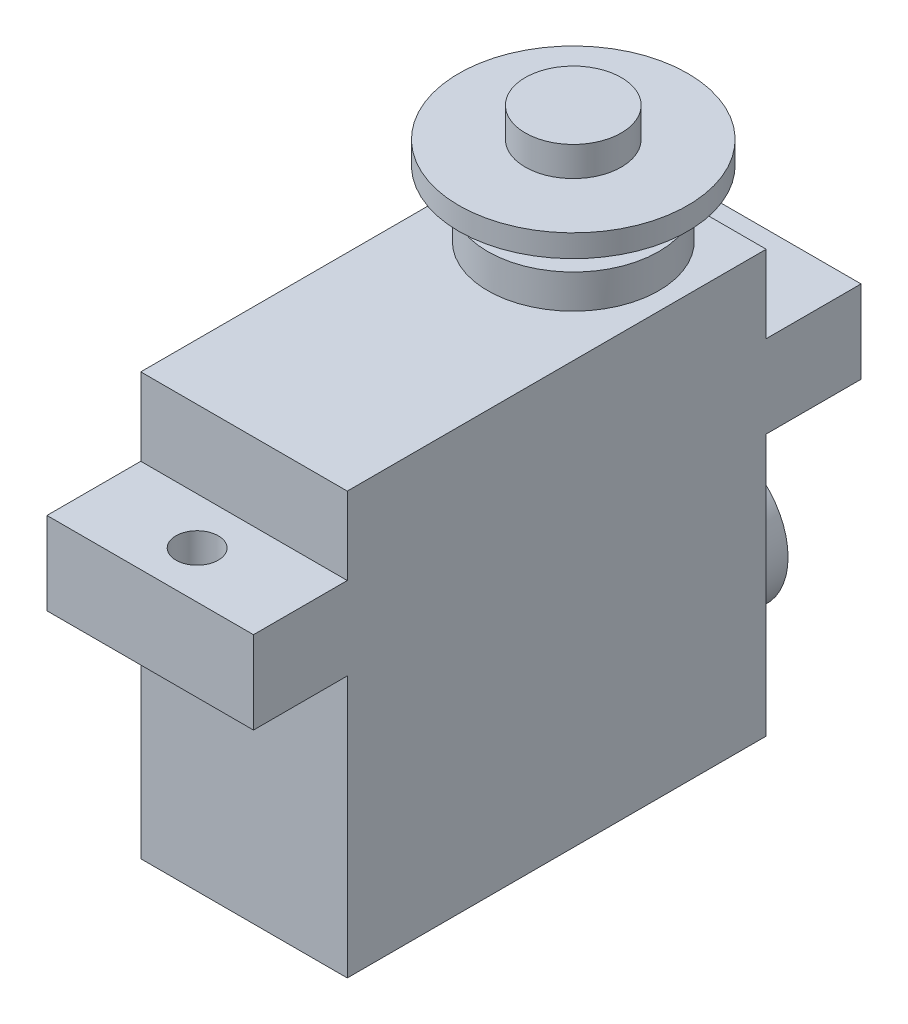
ISO-10303-21;
HEADER;
FILE_DESCRIPTION(('STEP AP214'),'2;1');
FILE_NAME('part.step','',(''),(''),'','','');
FILE_SCHEMA(('AUTOMOTIVE_DESIGN { 1 0 10303 214 1 1 1 1 }'));
ENDSEC;
DATA;
#1=APPLICATION_CONTEXT('core data for automotive mechanical design processes');
#2=APPLICATION_PROTOCOL_DEFINITION('international standard','automotive_design',2000,#1);
#3=PRODUCT_CONTEXT('',#1,'mechanical');
#4=PRODUCT('Part','Part','',(#3));
#5=PRODUCT_RELATED_PRODUCT_CATEGORY('part','',(#4));
#6=PRODUCT_DEFINITION_FORMATION('','',#4);
#7=PRODUCT_DEFINITION_CONTEXT('part definition',#1,'design');
#8=PRODUCT_DEFINITION('design','',#6,#7);
#9=PRODUCT_DEFINITION_SHAPE('','',#8);
#10=(LENGTH_UNIT() NAMED_UNIT(*) SI_UNIT(.MILLI.,.METRE.));
#11=(NAMED_UNIT(*) PLANE_ANGLE_UNIT() SI_UNIT($,.RADIAN.));
#12=(NAMED_UNIT(*) SI_UNIT($,.STERADIAN.) SOLID_ANGLE_UNIT());
#13=UNCERTAINTY_MEASURE_WITH_UNIT(LENGTH_MEASURE(1.E-05),#10,'distance_accuracy_value','');
#14=(GEOMETRIC_REPRESENTATION_CONTEXT(3) GLOBAL_UNCERTAINTY_ASSIGNED_CONTEXT((#13)) GLOBAL_UNIT_ASSIGNED_CONTEXT((#10,
#11,#12)) REPRESENTATION_CONTEXT('',''));
#15=CARTESIAN_POINT('',(0.,0.,0.));
#16=DIRECTION('',(0.,0.,1.));
#17=DIRECTION('',(1.,0.,0.));
#18=AXIS2_PLACEMENT_3D('',#15,#16,#17);
#19=CARTESIAN_POINT('',(0.,31.115,0.));
#20=DIRECTION('',(0.,0.,-1.));
#21=DIRECTION('',(-1.,0.,0.));
#22=AXIS2_PLACEMENT_3D('',#19,#20,#21);
#23=PLANE('',#22);
#24=DIRECTION('',(0.,-1.,0.));
#25=VECTOR('',#24,1.);
#26=CARTESIAN_POINT('',(0.,31.115,0.));
#27=LINE('',#26,#25);
#28=CARTESIAN_POINT('',(0.,31.115,0.));
#29=VERTEX_POINT('',#28);
#30=CARTESIAN_POINT('',(0.,25.4,0.));
#31=VERTEX_POINT('',#30);
#32=EDGE_CURVE('E220',#29,#31,#27,.T.);
#33=ORIENTED_EDGE('',*,*,#32,.T.);
#34=DIRECTION('',(1.,0.,0.));
#35=VECTOR('',#34,1.);
#36=CARTESIAN_POINT('',(0.,25.4,0.));
#37=LINE('',#36,#35);
#38=CARTESIAN_POINT('',(15.2399999999999,25.4,0.));
#39=VERTEX_POINT('',#38);
#40=EDGE_CURVE('E185',#31,#39,#37,.T.);
#41=ORIENTED_EDGE('',*,*,#40,.T.);
#42=DIRECTION('',(0.,-1.,0.));
#43=VECTOR('',#42,1.);
#44=CARTESIAN_POINT('',(15.2399999999999,31.115,0.));
#45=LINE('',#44,#43);
#46=CARTESIAN_POINT('',(15.2399999999999,31.115,0.));
#47=VERTEX_POINT('',#46);
#48=EDGE_CURVE('E217',#47,#39,#45,.T.);
#49=ORIENTED_EDGE('',*,*,#48,.F.);
#50=DIRECTION('',(1.,0.,0.));
#51=VECTOR('',#50,1.);
#52=CARTESIAN_POINT('',(0.,31.115,0.));
#53=LINE('',#52,#51);
#54=EDGE_CURVE('E192',#29,#47,#53,.T.);
#55=ORIENTED_EDGE('',*,*,#54,.F.);
#56=EDGE_LOOP('',(#33,#41,#49,#55));
#57=FACE_BOUND('',#56,.T.);
#58=ADVANCED_FACE('F42',(#57),#23,.F.);
#59=CARTESIAN_POINT('',(0.,31.115,-30.9117999999999));
#60=DIRECTION('',(0.,0.,1.));
#61=DIRECTION('',(1.,0.,0.));
#62=AXIS2_PLACEMENT_3D('',#59,#60,#61);
#63=PLANE('',#62);
#64=DIRECTION('',(0.,-1.,0.));
#65=VECTOR('',#64,1.);
#66=CARTESIAN_POINT('',(15.2399999999999,31.115,-30.9118));
#67=LINE('',#66,#65);
#68=CARTESIAN_POINT('',(15.2399999999999,31.115,-30.9118));
#69=VERTEX_POINT('',#68);
#70=CARTESIAN_POINT('',(15.2399999999999,25.4,-30.9118));
#71=VERTEX_POINT('',#70);
#72=EDGE_CURVE('E213',#69,#71,#67,.T.);
#73=ORIENTED_EDGE('',*,*,#72,.T.);
#74=DIRECTION('',(-1.,0.,0.));
#75=VECTOR('',#74,1.);
#76=CARTESIAN_POINT('',(0.,25.4,-30.9117999999999));
#77=LINE('',#76,#75);
#78=CARTESIAN_POINT('',(0.,25.4,-30.9118));
#79=VERTEX_POINT('',#78);
#80=EDGE_CURVE('E225',#71,#79,#77,.T.);
#81=ORIENTED_EDGE('',*,*,#80,.T.);
#82=DIRECTION('',(0.,-1.,0.));
#83=VECTOR('',#82,1.);
#84=CARTESIAN_POINT('',(0.,31.115,-30.9117999999999));
#85=LINE('',#84,#83);
#86=CARTESIAN_POINT('',(0.,31.115,-30.9117999999999));
#87=VERTEX_POINT('',#86);
#88=EDGE_CURVE('E209',#87,#79,#85,.T.);
#89=ORIENTED_EDGE('',*,*,#88,.F.);
#90=DIRECTION('',(-1.,0.,0.));
#91=VECTOR('',#90,1.);
#92=CARTESIAN_POINT('',(0.,31.115,-30.9117999999999));
#93=LINE('',#92,#91);
#94=EDGE_CURVE('E197',#69,#87,#93,.T.);
#95=ORIENTED_EDGE('',*,*,#94,.F.);
#96=EDGE_LOOP('',(#73,#81,#89,#95));
#97=FACE_BOUND('',#96,.T.);
#98=ADVANCED_FACE('F295',(#97),#63,.F.);
#99=CARTESIAN_POINT('',(0.,31.115,0.));
#100=DIRECTION('',(1.,0.,0.));
#101=DIRECTION('',(0.,0.,-1.));
#102=AXIS2_PLACEMENT_3D('',#99,#100,#101);
#103=PLANE('',#102);
#104=CARTESIAN_POINT('',(0.,19.304,0.));
#105=VERTEX_POINT('',#104);
#106=CARTESIAN_POINT('',(0.,0.,0.));
#107=VERTEX_POINT('',#106);
#108=EDGE_CURVE('E137',#105,#107,#27,.T.);
#109=ORIENTED_EDGE('',*,*,#108,.F.);
#110=DIRECTION('',(0.,0.,1.));
#111=VECTOR('',#110,1.);
#112=CARTESIAN_POINT('',(0.,19.304,-37.9095));
#113=LINE('',#112,#111);
#114=CARTESIAN_POINT('',(0.,19.304,6.9215));
#115=VERTEX_POINT('',#114);
#116=EDGE_CURVE('E59',#105,#115,#113,.T.);
#117=ORIENTED_EDGE('',*,*,#116,.T.);
#118=DIRECTION('',(0.,-1.,0.));
#119=VECTOR('',#118,1.);
#120=CARTESIAN_POINT('',(0.,25.4,6.9215));
#121=LINE('',#120,#119);
#122=CARTESIAN_POINT('',(0.,25.4,6.9215));
#123=VERTEX_POINT('',#122);
#124=EDGE_CURVE('E135',#123,#115,#121,.T.);
#125=ORIENTED_EDGE('',*,*,#124,.F.);
#126=DIRECTION('',(0.,0.,1.));
#127=VECTOR('',#126,1.);
#128=CARTESIAN_POINT('',(0.,25.4,-37.9095));
#129=LINE('',#128,#127);
#130=EDGE_CURVE('E177',#31,#123,#129,.T.);
#131=ORIENTED_EDGE('',*,*,#130,.F.);
#132=ORIENTED_EDGE('',*,*,#32,.F.);
#133=DIRECTION('',(0.,0.,1.));
#134=VECTOR('',#133,1.);
#135=CARTESIAN_POINT('',(0.,31.115,0.));
#136=LINE('',#135,#134);
#137=EDGE_CURVE('E189',#87,#29,#136,.T.);
#138=ORIENTED_EDGE('',*,*,#137,.F.);
#139=ORIENTED_EDGE('',*,*,#88,.T.);
#140=CARTESIAN_POINT('',(0.,25.4,-37.9095));
#141=VERTEX_POINT('',#140);
#142=EDGE_CURVE('E174',#141,#79,#129,.T.);
#143=ORIENTED_EDGE('',*,*,#142,.F.);
#144=DIRECTION('',(0.,-1.,0.));
#145=VECTOR('',#144,1.);
#146=CARTESIAN_POINT('',(0.,25.4,-37.9095));
#147=LINE('',#146,#145);
#148=CARTESIAN_POINT('',(0.,19.304,-37.9095));
#149=VERTEX_POINT('',#148);
#150=EDGE_CURVE('E164',#141,#149,#147,.T.);
#151=ORIENTED_EDGE('',*,*,#150,.T.);
#152=CARTESIAN_POINT('',(0.,19.304,-30.9118));
#153=VERTEX_POINT('',#152);
#154=EDGE_CURVE('E138',#149,#153,#113,.T.);
#155=ORIENTED_EDGE('',*,*,#154,.T.);
#156=CARTESIAN_POINT('',(0.,0.,-30.9117999999999));
#157=VERTEX_POINT('',#156);
#158=EDGE_CURVE('E199',#153,#157,#85,.T.);
#159=ORIENTED_EDGE('',*,*,#158,.T.);
#160=DIRECTION('',(0.,0.,1.));
#161=VECTOR('',#160,1.);
#162=CARTESIAN_POINT('',(0.,0.,0.));
#163=LINE('',#162,#161);
#164=EDGE_CURVE('E188',#157,#107,#163,.T.);
#165=ORIENTED_EDGE('',*,*,#164,.T.);
#166=EDGE_LOOP('',(#109,#117,#125,#131,#132,#138,#139,#143,#151,#155,#159,#165));
#167=FACE_BOUND('',#166,.T.);
#168=ADVANCED_FACE('F44',(#167),#103,.F.);
#169=CARTESIAN_POINT('',(15.2399999999999,19.304,0.));
#170=VERTEX_POINT('',#169);
#171=CARTESIAN_POINT('',(15.2399999999999,0.,0.));
#172=VERTEX_POINT('',#171);
#173=EDGE_CURVE('E216',#170,#172,#45,.T.);
#174=ORIENTED_EDGE('',*,*,#173,.F.);
#175=DIRECTION('',(-1.,0.,0.));
#176=VECTOR('',#175,1.);
#177=CARTESIAN_POINT('',(0.,19.304,0.));
#178=LINE('',#177,#176);
#179=EDGE_CURVE('E176',#170,#105,#178,.T.);
#180=ORIENTED_EDGE('',*,*,#179,.T.);
#181=ORIENTED_EDGE('',*,*,#108,.T.);
#182=DIRECTION('',(1.,0.,0.));
#183=VECTOR('',#182,1.);
#184=CARTESIAN_POINT('',(0.,0.,0.));
#185=LINE('',#184,#183);
#186=EDGE_CURVE('E201',#107,#172,#185,.T.);
#187=ORIENTED_EDGE('',*,*,#186,.T.);
#188=EDGE_LOOP('',(#174,#180,#181,#187));
#189=FACE_BOUND('',#188,.T.);
#190=ADVANCED_FACE('F318',(#189),#23,.F.);
#191=CARTESIAN_POINT('',(15.2399999999999,31.115,0.));
#192=DIRECTION('',(-1.,0.,0.));
#193=DIRECTION('',(0.,0.,1.));
#194=AXIS2_PLACEMENT_3D('',#191,#192,#193);
#195=PLANE('',#194);
#196=CARTESIAN_POINT('',(15.2399999999999,19.304,-30.9118));
#197=VERTEX_POINT('',#196);
#198=CARTESIAN_POINT('',(15.2399999999999,0.,-30.9118));
#199=VERTEX_POINT('',#198);
#200=EDGE_CURVE('E212',#197,#199,#67,.T.);
#201=ORIENTED_EDGE('',*,*,#200,.F.);
#202=DIRECTION('',(0.,0.,1.));
#203=VECTOR('',#202,1.);
#204=CARTESIAN_POINT('',(15.2399999999999,19.304,-37.9095));
#205=LINE('',#204,#203);
#206=CARTESIAN_POINT('',(15.2399999999999,19.304,-37.9095));
#207=VERTEX_POINT('',#206);
#208=EDGE_CURVE('E67',#207,#197,#205,.T.);
#209=ORIENTED_EDGE('',*,*,#208,.F.);
#210=DIRECTION('',(0.,1.,0.));
#211=VECTOR('',#210,1.);
#212=CARTESIAN_POINT('',(15.2399999999999,25.4,-37.9095));
#213=LINE('',#212,#211);
#214=CARTESIAN_POINT('',(15.2399999999999,25.4,-37.9095));
#215=VERTEX_POINT('',#214);
#216=EDGE_CURVE('E169',#207,#215,#213,.T.);
#217=ORIENTED_EDGE('',*,*,#216,.T.);
#218=DIRECTION('',(0.,0.,1.));
#219=VECTOR('',#218,1.);
#220=CARTESIAN_POINT('',(15.2399999999999,25.4,-37.9095));
#221=LINE('',#220,#219);
#222=EDGE_CURVE('E178',#215,#71,#221,.T.);
#223=ORIENTED_EDGE('',*,*,#222,.T.);
#224=ORIENTED_EDGE('',*,*,#72,.F.);
#225=DIRECTION('',(0.,0.,-1.));
#226=VECTOR('',#225,1.);
#227=CARTESIAN_POINT('',(15.2399999999999,31.115,0.));
#228=LINE('',#227,#226);
#229=EDGE_CURVE('E195',#47,#69,#228,.T.);
#230=ORIENTED_EDGE('',*,*,#229,.F.);
#231=ORIENTED_EDGE('',*,*,#48,.T.);
#232=CARTESIAN_POINT('',(15.2399999999999,25.4,6.9215));
#233=VERTEX_POINT('',#232);
#234=EDGE_CURVE('E181',#39,#233,#221,.T.);
#235=ORIENTED_EDGE('',*,*,#234,.T.);
#236=DIRECTION('',(0.,1.,0.));
#237=VECTOR('',#236,1.);
#238=CARTESIAN_POINT('',(15.2399999999999,25.4,6.9215));
#239=LINE('',#238,#237);
#240=CARTESIAN_POINT('',(15.2399999999999,19.304,6.9215));
#241=VERTEX_POINT('',#240);
#242=EDGE_CURVE('E149',#241,#233,#239,.T.);
#243=ORIENTED_EDGE('',*,*,#242,.F.);
#244=EDGE_CURVE('E145',#170,#241,#205,.T.);
#245=ORIENTED_EDGE('',*,*,#244,.F.);
#246=ORIENTED_EDGE('',*,*,#173,.T.);
#247=DIRECTION('',(0.,0.,-1.));
#248=VECTOR('',#247,1.);
#249=CARTESIAN_POINT('',(15.2399999999999,0.,0.));
#250=LINE('',#249,#248);
#251=EDGE_CURVE('E204',#172,#199,#250,.T.);
#252=ORIENTED_EDGE('',*,*,#251,.T.);
#253=EDGE_LOOP('',(#201,#209,#217,#223,#224,#230,#231,#235,#243,#245,#246,#252));
#254=FACE_BOUND('',#253,.T.);
#255=ADVANCED_FACE('F290',(#254),#195,.F.);
#256=CARTESIAN_POINT('',(7.61999999999996,8.2804,-30.9118));
#257=DIRECTION('',(0.,0.,1.));
#258=DIRECTION('',(1.,0.,0.));
#259=AXIS2_PLACEMENT_3D('',#256,#257,#258);
#260=CIRCLE('',#259,5.2705);
#261=CARTESIAN_POINT('',(12.8905,8.2804,-30.9118));
#262=VERTEX_POINT('',#261);
#263=EDGE_CURVE('E227',#262,#262,#260,.F.);
#264=ORIENTED_EDGE('',*,*,#263,.F.);
#265=EDGE_LOOP('',(#264));
#266=FACE_BOUND('',#265,.T.);
#267=ORIENTED_EDGE('',*,*,#158,.F.);
#268=DIRECTION('',(1.,0.,0.));
#269=VECTOR('',#268,1.);
#270=CARTESIAN_POINT('',(0.,19.304,-30.9117999999999));
#271=LINE('',#270,#269);
#272=EDGE_CURVE('E223',#153,#197,#271,.T.);
#273=ORIENTED_EDGE('',*,*,#272,.T.);
#274=ORIENTED_EDGE('',*,*,#200,.T.);
#275=DIRECTION('',(-1.,0.,0.));
#276=VECTOR('',#275,1.);
#277=CARTESIAN_POINT('',(0.,0.,-30.9117999999999));
#278=LINE('',#277,#276);
#279=EDGE_CURVE('E193',#199,#157,#278,.T.);
#280=ORIENTED_EDGE('',*,*,#279,.T.);
#281=EDGE_LOOP('',(#267,#273,#274,#280));
#282=FACE_BOUND('',#281,.T.);
#283=ADVANCED_FACE('F309',(#266,#282),#63,.F.);
#284=CARTESIAN_POINT('',(0.,31.115,0.));
#285=DIRECTION('',(0.,-1.,0.));
#286=DIRECTION('',(0.,0.,-1.));
#287=AXIS2_PLACEMENT_3D('',#284,#285,#286);
#288=PLANE('',#287);
#289=CARTESIAN_POINT('',(7.61999999999996,31.115,-24.2951));
#290=DIRECTION('',(0.,-1.,0.));
#291=DIRECTION('',(0.,0.,-1.));
#292=AXIS2_PLACEMENT_3D('',#289,#290,#291);
#293=CIRCLE('',#292,6.3119);
#294=CARTESIAN_POINT('',(7.61999999999996,31.115,-30.607));
#295=VERTEX_POINT('',#294);
#296=EDGE_CURVE('E46',#295,#295,#293,.F.);
#297=ORIENTED_EDGE('',*,*,#296,.F.);
#298=EDGE_LOOP('',(#297));
#299=FACE_BOUND('',#298,.T.);
#300=ORIENTED_EDGE('',*,*,#137,.T.);
#301=ORIENTED_EDGE('',*,*,#54,.T.);
#302=ORIENTED_EDGE('',*,*,#229,.T.);
#303=ORIENTED_EDGE('',*,*,#94,.T.);
#304=EDGE_LOOP('',(#300,#301,#302,#303));
#305=FACE_BOUND('',#304,.T.);
#306=ADVANCED_FACE('F298',(#299,#305),#288,.F.);
#307=CARTESIAN_POINT('',(0.,0.,0.));
#308=DIRECTION('',(0.,-1.,0.));
#309=DIRECTION('',(0.,0.,-1.));
#310=AXIS2_PLACEMENT_3D('',#307,#308,#309);
#311=PLANE('',#310);
#312=ORIENTED_EDGE('',*,*,#164,.F.);
#313=ORIENTED_EDGE('',*,*,#279,.F.);
#314=ORIENTED_EDGE('',*,*,#251,.F.);
#315=ORIENTED_EDGE('',*,*,#186,.F.);
#316=EDGE_LOOP('',(#312,#313,#314,#315));
#317=FACE_BOUND('',#316,.T.);
#318=ADVANCED_FACE('F315',(#317),#311,.T.);
#319=CARTESIAN_POINT('',(0.,0.,-37.9095));
#320=DIRECTION('',(0.,0.,1.));
#321=DIRECTION('',(1.,0.,0.));
#322=AXIS2_PLACEMENT_3D('',#319,#320,#321);
#323=PLANE('',#322);
#324=ORIENTED_EDGE('',*,*,#150,.F.);
#325=DIRECTION('',(-1.,0.,0.));
#326=VECTOR('',#325,1.);
#327=CARTESIAN_POINT('',(0.,25.4,-37.9095));
#328=LINE('',#327,#326);
#329=EDGE_CURVE('E139',#215,#141,#328,.T.);
#330=ORIENTED_EDGE('',*,*,#329,.F.);
#331=ORIENTED_EDGE('',*,*,#216,.F.);
#332=DIRECTION('',(1.,0.,0.));
#333=VECTOR('',#332,1.);
#334=CARTESIAN_POINT('',(0.,19.304,-37.9095));
#335=LINE('',#334,#333);
#336=EDGE_CURVE('E167',#149,#207,#335,.T.);
#337=ORIENTED_EDGE('',*,*,#336,.F.);
#338=EDGE_LOOP('',(#324,#330,#331,#337));
#339=FACE_BOUND('',#338,.T.);
#340=ADVANCED_FACE('F306',(#339),#323,.F.);
#341=CARTESIAN_POINT('',(0.,19.304,-37.9095));
#342=DIRECTION('',(0.,-1.,0.));
#343=DIRECTION('',(0.,0.,-1.));
#344=AXIS2_PLACEMENT_3D('',#341,#342,#343);
#345=PLANE('',#344);
#346=CARTESIAN_POINT('',(7.61999999999996,19.304,-34.41065));
#347=DIRECTION('',(0.,-1.,0.));
#348=DIRECTION('',(0.,0.,-1.));
#349=AXIS2_PLACEMENT_3D('',#346,#347,#348);
#350=CIRCLE('',#349,1.5621);
#351=CARTESIAN_POINT('',(7.61999999999996,19.304,-35.97275));
#352=VERTEX_POINT('',#351);
#353=EDGE_CURVE('E267',#352,#352,#350,.F.);
#354=ORIENTED_EDGE('',*,*,#353,.T.);
#355=EDGE_LOOP('',(#354));
#356=FACE_BOUND('',#355,.T.);
#357=ORIENTED_EDGE('',*,*,#272,.F.);
#358=ORIENTED_EDGE('',*,*,#154,.F.);
#359=ORIENTED_EDGE('',*,*,#336,.T.);
#360=ORIENTED_EDGE('',*,*,#208,.T.);
#361=EDGE_LOOP('',(#357,#358,#359,#360));
#362=FACE_BOUND('',#361,.T.);
#363=ADVANCED_FACE('F271',(#356,#362),#345,.T.);
#364=CARTESIAN_POINT('',(0.,25.4,-37.9095));
#365=DIRECTION('',(0.,1.,0.));
#366=DIRECTION('',(0.,0.,1.));
#367=AXIS2_PLACEMENT_3D('',#364,#365,#366);
#368=PLANE('',#367);
#369=CARTESIAN_POINT('',(7.61999999999996,25.4,-34.41065));
#370=DIRECTION('',(0.,1.,0.));
#371=DIRECTION('',(0.,0.,1.));
#372=AXIS2_PLACEMENT_3D('',#369,#370,#371);
#373=CIRCLE('',#372,1.5621);
#374=CARTESIAN_POINT('',(7.61999999999996,25.4,-32.84855));
#375=VERTEX_POINT('',#374);
#376=EDGE_CURVE('E262',#375,#375,#373,.T.);
#377=ORIENTED_EDGE('',*,*,#376,.F.);
#378=EDGE_LOOP('',(#377));
#379=FACE_BOUND('',#378,.T.);
#380=ORIENTED_EDGE('',*,*,#80,.F.);
#381=ORIENTED_EDGE('',*,*,#222,.F.);
#382=ORIENTED_EDGE('',*,*,#329,.T.);
#383=ORIENTED_EDGE('',*,*,#142,.T.);
#384=EDGE_LOOP('',(#380,#381,#382,#383));
#385=FACE_BOUND('',#384,.T.);
#386=ADVANCED_FACE('F280',(#379,#385),#368,.T.);
#387=CARTESIAN_POINT('',(7.61999999999996,25.4,3.46075));
#388=DIRECTION('',(0.,1.,0.));
#389=DIRECTION('',(0.,0.,1.));
#390=AXIS2_PLACEMENT_3D('',#387,#388,#389);
#391=CIRCLE('',#390,1.5621);
#392=CARTESIAN_POINT('',(7.61999999999996,25.4,5.02285));
#393=VERTEX_POINT('',#392);
#394=EDGE_CURVE('E258',#393,#393,#391,.T.);
#395=ORIENTED_EDGE('',*,*,#394,.F.);
#396=EDGE_LOOP('',(#395));
#397=FACE_BOUND('',#396,.T.);
#398=ORIENTED_EDGE('',*,*,#40,.F.);
#399=ORIENTED_EDGE('',*,*,#130,.T.);
#400=DIRECTION('',(-1.,0.,0.));
#401=VECTOR('',#400,1.);
#402=CARTESIAN_POINT('',(0.,25.4,6.9215));
#403=LINE('',#402,#401);
#404=EDGE_CURVE('E154',#233,#123,#403,.T.);
#405=ORIENTED_EDGE('',*,*,#404,.F.);
#406=ORIENTED_EDGE('',*,*,#234,.F.);
#407=EDGE_LOOP('',(#398,#399,#405,#406));
#408=FACE_BOUND('',#407,.T.);
#409=ADVANCED_FACE('F283',(#397,#408),#368,.T.);
#410=CARTESIAN_POINT('',(7.61999999999996,19.304,3.46075));
#411=DIRECTION('',(0.,-1.,0.));
#412=DIRECTION('',(0.,0.,-1.));
#413=AXIS2_PLACEMENT_3D('',#410,#411,#412);
#414=CIRCLE('',#413,1.5621);
#415=CARTESIAN_POINT('',(7.61999999999996,19.304,1.89865));
#416=VERTEX_POINT('',#415);
#417=EDGE_CURVE('E259',#416,#416,#414,.F.);
#418=ORIENTED_EDGE('',*,*,#417,.T.);
#419=EDGE_LOOP('',(#418));
#420=FACE_BOUND('',#419,.T.);
#421=ORIENTED_EDGE('',*,*,#179,.F.);
#422=ORIENTED_EDGE('',*,*,#244,.T.);
#423=DIRECTION('',(1.,0.,0.));
#424=VECTOR('',#423,1.);
#425=CARTESIAN_POINT('',(0.,19.304,6.9215));
#426=LINE('',#425,#424);
#427=EDGE_CURVE('E142',#115,#241,#426,.T.);
#428=ORIENTED_EDGE('',*,*,#427,.F.);
#429=ORIENTED_EDGE('',*,*,#116,.F.);
#430=EDGE_LOOP('',(#421,#422,#428,#429));
#431=FACE_BOUND('',#430,.T.);
#432=ADVANCED_FACE('F143',(#420,#431),#345,.T.);
#433=CARTESIAN_POINT('',(0.,0.,6.9215));
#434=DIRECTION('',(0.,0.,1.));
#435=DIRECTION('',(1.,0.,0.));
#436=AXIS2_PLACEMENT_3D('',#433,#434,#435);
#437=PLANE('',#436);
#438=ORIENTED_EDGE('',*,*,#124,.T.);
#439=ORIENTED_EDGE('',*,*,#427,.T.);
#440=ORIENTED_EDGE('',*,*,#242,.T.);
#441=ORIENTED_EDGE('',*,*,#404,.T.);
#442=EDGE_LOOP('',(#438,#439,#440,#441));
#443=FACE_BOUND('',#442,.T.);
#444=ADVANCED_FACE('F152',(#443),#437,.T.);
#445=CARTESIAN_POINT('',(7.61999999999994,8.2804,-34.8742));
#446=DIRECTION('',(0.,0.,1.));
#447=DIRECTION('',(1.,0.,0.));
#448=AXIS2_PLACEMENT_3D('',#445,#446,#447);
#449=CYLINDRICAL_SURFACE('',#448,5.2705);
#450=CARTESIAN_POINT('',(7.61999999999994,8.2804,-34.8742));
#451=DIRECTION('',(0.,0.,-1.));
#452=DIRECTION('',(-1.,0.,0.));
#453=AXIS2_PLACEMENT_3D('',#450,#451,#452);
#454=CIRCLE('',#453,5.2705);
#455=CARTESIAN_POINT('',(2.34949999999994,8.2804,-34.8741999999999));
#456=VERTEX_POINT('',#455);
#457=EDGE_CURVE('E155',#456,#456,#454,.T.);
#458=ORIENTED_EDGE('',*,*,#457,.F.);
#459=EDGE_LOOP('',(#458));
#460=FACE_BOUND('',#459,.T.);
#461=ORIENTED_EDGE('',*,*,#263,.T.);
#462=EDGE_LOOP('',(#461));
#463=FACE_BOUND('',#462,.T.);
#464=ADVANCED_FACE('F353',(#460,#463),#449,.T.);
#465=CARTESIAN_POINT('',(7.61999999999994,8.2804,-34.8742));
#466=DIRECTION('',(0.,0.,-1.));
#467=DIRECTION('',(-1.,0.,0.));
#468=AXIS2_PLACEMENT_3D('',#465,#466,#467);
#469=PLANE('',#468);
#470=ORIENTED_EDGE('',*,*,#457,.T.);
#471=EDGE_LOOP('',(#470));
#472=FACE_BOUND('',#471,.T.);
#473=ADVANCED_FACE('F356',(#472),#469,.T.);
#474=CARTESIAN_POINT('',(7.61999999999996,33.6169,-24.2951));
#475=DIRECTION('',(0.,-1.,0.));
#476=DIRECTION('',(0.,0.,-1.));
#477=AXIS2_PLACEMENT_3D('',#474,#475,#476);
#478=CYLINDRICAL_SURFACE('',#477,6.3119);
#479=CARTESIAN_POINT('',(7.61999999999996,33.6169,-24.2951));
#480=DIRECTION('',(0.,1.,0.));
#481=DIRECTION('',(0.,0.,1.));
#482=AXIS2_PLACEMENT_3D('',#479,#480,#481);
#483=CIRCLE('',#482,6.3119);
#484=CARTESIAN_POINT('',(7.61999999999996,33.6169,-17.9832));
#485=VERTEX_POINT('',#484);
#486=EDGE_CURVE('E158',#485,#485,#483,.T.);
#487=ORIENTED_EDGE('',*,*,#486,.F.);
#488=EDGE_LOOP('',(#487));
#489=FACE_BOUND('',#488,.T.);
#490=ORIENTED_EDGE('',*,*,#296,.T.);
#491=EDGE_LOOP('',(#490));
#492=FACE_BOUND('',#491,.T.);
#493=ADVANCED_FACE('F360',(#489,#492),#478,.T.);
#494=CARTESIAN_POINT('',(7.61999999999996,33.6169,-24.2951));
#495=DIRECTION('',(0.,1.,0.));
#496=DIRECTION('',(0.,0.,1.));
#497=AXIS2_PLACEMENT_3D('',#494,#495,#496);
#498=PLANE('',#497);
#499=CARTESIAN_POINT('',(7.61999999999996,33.6169,-24.2951));
#500=DIRECTION('',(0.,1.,0.));
#501=DIRECTION('',(0.,0.,1.));
#502=AXIS2_PLACEMENT_3D('',#499,#500,#501);
#503=CIRCLE('',#502,3.99415);
#504=CARTESIAN_POINT('',(7.61999999999996,33.6169,-20.30095));
#505=VERTEX_POINT('',#504);
#506=EDGE_CURVE('E51',#505,#505,#503,.T.);
#507=ORIENTED_EDGE('',*,*,#506,.F.);
#508=EDGE_LOOP('',(#507));
#509=FACE_BOUND('',#508,.T.);
#510=ORIENTED_EDGE('',*,*,#486,.T.);
#511=EDGE_LOOP('',(#510));
#512=FACE_BOUND('',#511,.T.);
#513=ADVANCED_FACE('F364',(#509,#512),#498,.T.);
#514=CARTESIAN_POINT('',(7.61999999999996,35.9791,-24.2951));
#515=DIRECTION('',(0.,-1.,0.));
#516=DIRECTION('',(0.,0.,-1.));
#517=AXIS2_PLACEMENT_3D('',#514,#515,#516);
#518=CYLINDRICAL_SURFACE('',#517,3.99415);
#519=CARTESIAN_POINT('',(7.61999999999996,35.9791,-24.2951));
#520=DIRECTION('',(0.,1.,0.));
#521=DIRECTION('',(0.,0.,1.));
#522=AXIS2_PLACEMENT_3D('',#519,#520,#521);
#523=CIRCLE('',#522,3.99415);
#524=CARTESIAN_POINT('',(7.61999999999996,35.9791,-20.30095));
#525=VERTEX_POINT('',#524);
#526=EDGE_CURVE('E239',#525,#525,#523,.T.);
#527=ORIENTED_EDGE('',*,*,#526,.F.);
#528=EDGE_LOOP('',(#527));
#529=FACE_BOUND('',#528,.T.);
#530=ORIENTED_EDGE('',*,*,#506,.T.);
#531=EDGE_LOOP('',(#530));
#532=FACE_BOUND('',#531,.T.);
#533=ADVANCED_FACE('F368',(#529,#532),#518,.T.);
#534=CARTESIAN_POINT('',(7.61999999999996,37.6301,-24.2951));
#535=DIRECTION('',(0.,-1.,0.));
#536=DIRECTION('',(0.,0.,-1.));
#537=AXIS2_PLACEMENT_3D('',#534,#535,#536);
#538=CYLINDRICAL_SURFACE('',#537,8.4455);
#539=CARTESIAN_POINT('',(7.61999999999996,37.6301,-24.2951));
#540=DIRECTION('',(0.,1.,0.));
#541=DIRECTION('',(0.,0.,1.));
#542=AXIS2_PLACEMENT_3D('',#539,#540,#541);
#543=CIRCLE('',#542,8.4455);
#544=CARTESIAN_POINT('',(7.61999999999996,37.6301,-15.8496));
#545=VERTEX_POINT('',#544);
#546=EDGE_CURVE('E245',#545,#545,#543,.T.);
#547=ORIENTED_EDGE('',*,*,#546,.F.);
#548=EDGE_LOOP('',(#547));
#549=FACE_BOUND('',#548,.T.);
#550=CARTESIAN_POINT('',(7.61999999999996,35.9791,-24.2951));
#551=DIRECTION('',(0.,1.,0.));
#552=DIRECTION('',(0.,0.,1.));
#553=AXIS2_PLACEMENT_3D('',#550,#551,#552);
#554=CIRCLE('',#553,8.4455);
#555=CARTESIAN_POINT('',(7.61999999999996,35.9791,-15.8496));
#556=VERTEX_POINT('',#555);
#557=EDGE_CURVE('E249',#556,#556,#554,.T.);
#558=ORIENTED_EDGE('',*,*,#557,.T.);
#559=EDGE_LOOP('',(#558));
#560=FACE_BOUND('',#559,.T.);
#561=ADVANCED_FACE('F372',(#549,#560),#538,.T.);
#562=CARTESIAN_POINT('',(7.61999999999996,37.6301,-24.2951));
#563=DIRECTION('',(0.,1.,0.));
#564=DIRECTION('',(0.,0.,1.));
#565=AXIS2_PLACEMENT_3D('',#562,#563,#564);
#566=PLANE('',#565);
#567=CARTESIAN_POINT('',(7.61999999999996,37.6301,-24.2951));
#568=DIRECTION('',(0.,1.,0.));
#569=DIRECTION('',(0.,0.,1.));
#570=AXIS2_PLACEMENT_3D('',#567,#568,#569);
#571=CIRCLE('',#570,3.5433);
#572=CARTESIAN_POINT('',(7.61999999999996,37.6301,-20.7518));
#573=VERTEX_POINT('',#572);
#574=EDGE_CURVE('E11',#573,#573,#571,.T.);
#575=ORIENTED_EDGE('',*,*,#574,.F.);
#576=EDGE_LOOP('',(#575));
#577=FACE_BOUND('',#576,.T.);
#578=ORIENTED_EDGE('',*,*,#546,.T.);
#579=EDGE_LOOP('',(#578));
#580=FACE_BOUND('',#579,.T.);
#581=ADVANCED_FACE('F376',(#577,#580),#566,.T.);
#582=CARTESIAN_POINT('',(7.61999999999996,35.9791,-24.2951));
#583=DIRECTION('',(0.,1.,0.));
#584=DIRECTION('',(0.,0.,1.));
#585=AXIS2_PLACEMENT_3D('',#582,#583,#584);
#586=PLANE('',#585);
#587=ORIENTED_EDGE('',*,*,#526,.T.);
#588=EDGE_LOOP('',(#587));
#589=FACE_BOUND('',#588,.T.);
#590=ORIENTED_EDGE('',*,*,#557,.F.);
#591=EDGE_LOOP('',(#590));
#592=FACE_BOUND('',#591,.T.);
#593=ADVANCED_FACE('F378',(#589,#592),#586,.F.);
#594=CARTESIAN_POINT('',(7.61999999999996,39.8145,-24.2951));
#595=DIRECTION('',(0.,-1.,0.));
#596=DIRECTION('',(0.,0.,-1.));
#597=AXIS2_PLACEMENT_3D('',#594,#595,#596);
#598=CYLINDRICAL_SURFACE('',#597,3.5433);
#599=CARTESIAN_POINT('',(7.61999999999996,39.8145,-24.2951));
#600=DIRECTION('',(0.,1.,0.));
#601=DIRECTION('',(0.,0.,1.));
#602=AXIS2_PLACEMENT_3D('',#599,#600,#601);
#603=CIRCLE('',#602,3.5433);
#604=CARTESIAN_POINT('',(7.61999999999996,39.8145,-20.7518));
#605=VERTEX_POINT('',#604);
#606=EDGE_CURVE('E254',#605,#605,#603,.T.);
#607=ORIENTED_EDGE('',*,*,#606,.F.);
#608=EDGE_LOOP('',(#607));
#609=FACE_BOUND('',#608,.T.);
#610=ORIENTED_EDGE('',*,*,#574,.T.);
#611=EDGE_LOOP('',(#610));
#612=FACE_BOUND('',#611,.T.);
#613=ADVANCED_FACE('F381',(#609,#612),#598,.T.);
#614=CARTESIAN_POINT('',(7.61999999999996,39.8145,-24.2951));
#615=DIRECTION('',(0.,1.,0.));
#616=DIRECTION('',(0.,0.,1.));
#617=AXIS2_PLACEMENT_3D('',#614,#615,#616);
#618=PLANE('',#617);
#619=ORIENTED_EDGE('',*,*,#606,.T.);
#620=EDGE_LOOP('',(#619));
#621=FACE_BOUND('',#620,.T.);
#622=ADVANCED_FACE('F387',(#621),#618,.T.);
#623=CARTESIAN_POINT('',(7.61999999999996,-0.001000000000001,3.46075));
#624=DIRECTION('',(0.,1.,0.));
#625=DIRECTION('',(0.,0.,1.));
#626=AXIS2_PLACEMENT_3D('',#623,#624,#625);
#627=CYLINDRICAL_SURFACE('',#626,1.5621);
#628=ORIENTED_EDGE('',*,*,#417,.F.);
#629=EDGE_LOOP('',(#628));
#630=FACE_BOUND('',#629,.T.);
#631=ORIENTED_EDGE('',*,*,#394,.T.);
#632=EDGE_LOOP('',(#631));
#633=FACE_BOUND('',#632,.T.);
#634=ADVANCED_FACE('F276',(#630,#633),#627,.F.);
#635=CARTESIAN_POINT('',(7.61999999999996,-0.001000000000001,-34.41065));
#636=DIRECTION('',(0.,1.,0.));
#637=DIRECTION('',(0.,0.,1.));
#638=AXIS2_PLACEMENT_3D('',#635,#636,#637);
#639=CYLINDRICAL_SURFACE('',#638,1.5621);
#640=ORIENTED_EDGE('',*,*,#353,.F.);
#641=EDGE_LOOP('',(#640));
#642=FACE_BOUND('',#641,.T.);
#643=ORIENTED_EDGE('',*,*,#376,.T.);
#644=EDGE_LOOP('',(#643));
#645=FACE_BOUND('',#644,.T.);
#646=ADVANCED_FACE('F273',(#642,#645),#639,.F.);
#647=CLOSED_SHELL('',(#58,#98,#168,#190,#255,#283,#306,#318,#340,#363,#386,#409,#432,#444,#464,
#473,#493,#513,#533,#561,#581,#593,#613,#622,#634,#646));
#648=MANIFOLD_SOLID_BREP('B2',#647);
#649=ADVANCED_BREP_SHAPE_REPRESENTATION('',(#18,#648),#14);
#650=SHAPE_DEFINITION_REPRESENTATION(#9,#649);
ENDSEC;
END-ISO-10303-21;
